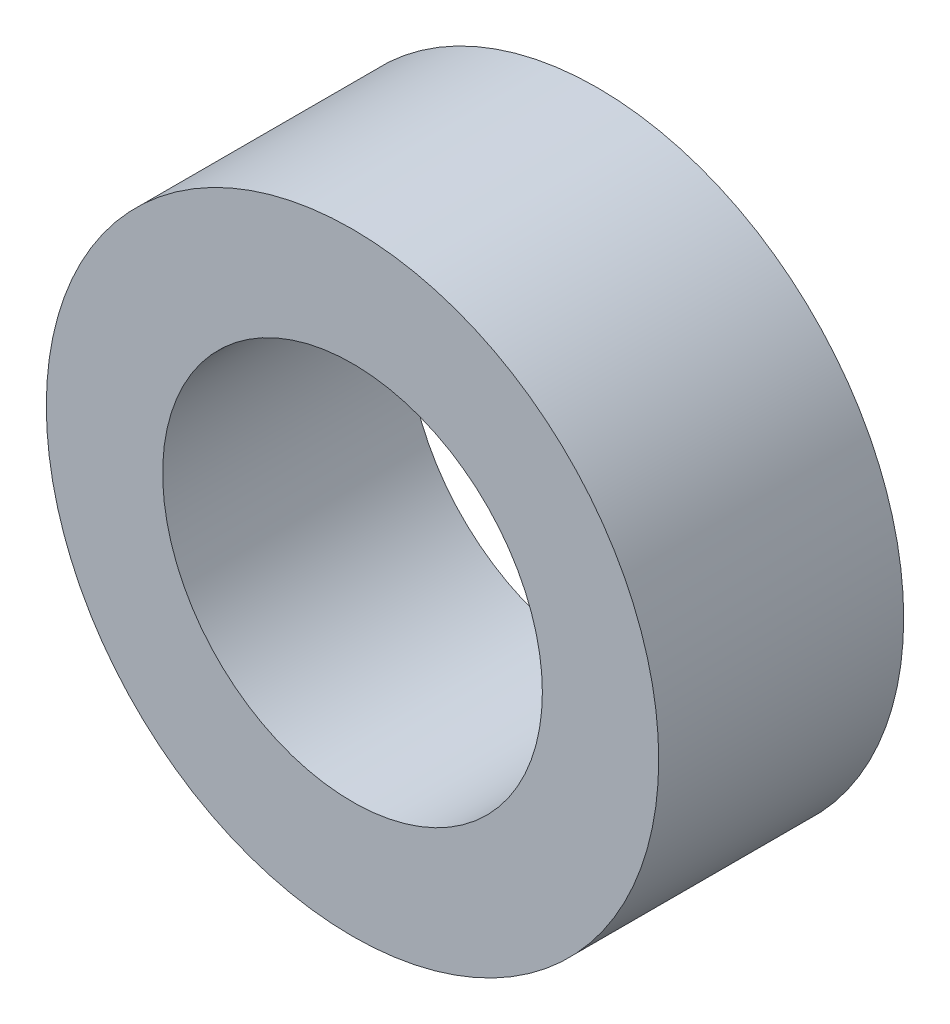
ISO-10303-21;
HEADER;
FILE_DESCRIPTION(('STEP AP214'),'2;1');
FILE_NAME('part.step','',(''),(''),'','','');
FILE_SCHEMA(('AUTOMOTIVE_DESIGN { 1 0 10303 214 1 1 1 1 }'));
ENDSEC;
DATA;
#1=APPLICATION_CONTEXT('core data for automotive mechanical design processes');
#2=APPLICATION_PROTOCOL_DEFINITION('international standard','automotive_design',2000,#1);
#3=PRODUCT_CONTEXT('',#1,'mechanical');
#4=PRODUCT('Part','Part','',(#3));
#5=PRODUCT_RELATED_PRODUCT_CATEGORY('part','',(#4));
#6=PRODUCT_DEFINITION_FORMATION('','',#4);
#7=PRODUCT_DEFINITION_CONTEXT('part definition',#1,'design');
#8=PRODUCT_DEFINITION('design','',#6,#7);
#9=PRODUCT_DEFINITION_SHAPE('','',#8);
#10=(LENGTH_UNIT() NAMED_UNIT(*) SI_UNIT(.MILLI.,.METRE.));
#11=(NAMED_UNIT(*) PLANE_ANGLE_UNIT() SI_UNIT($,.RADIAN.));
#12=(NAMED_UNIT(*) SI_UNIT($,.STERADIAN.) SOLID_ANGLE_UNIT());
#13=UNCERTAINTY_MEASURE_WITH_UNIT(LENGTH_MEASURE(1.E-05),#10,'distance_accuracy_value','');
#14=(GEOMETRIC_REPRESENTATION_CONTEXT(3) GLOBAL_UNCERTAINTY_ASSIGNED_CONTEXT((#13)) GLOBAL_UNIT_ASSIGNED_CONTEXT((#10,
#11,#12)) REPRESENTATION_CONTEXT('',''));
#15=CARTESIAN_POINT('',(0.,0.,0.));
#16=DIRECTION('',(0.,0.,1.));
#17=DIRECTION('',(1.,0.,0.));
#18=AXIS2_PLACEMENT_3D('',#15,#16,#17);
#19=CARTESIAN_POINT('',(0.,0.,4.));
#20=DIRECTION('',(0.,0.,1.));
#21=DIRECTION('',(1.,0.,0.));
#22=AXIS2_PLACEMENT_3D('',#19,#20,#21);
#23=PLANE('',#22);
#24=CARTESIAN_POINT('',(0.,0.,4.));
#25=DIRECTION('',(0.,0.,1.));
#26=DIRECTION('',(1.,0.,0.));
#27=AXIS2_PLACEMENT_3D('',#24,#25,#26);
#28=CIRCLE('',#27,5.);
#29=CARTESIAN_POINT('',(5.,0.,4.));
#30=VERTEX_POINT('',#29);
#31=EDGE_CURVE('E10',#30,#30,#28,.T.);
#32=ORIENTED_EDGE('',*,*,#31,.T.);
#33=EDGE_LOOP('',(#32));
#34=FACE_BOUND('',#33,.T.);
#35=CARTESIAN_POINT('',(0.,0.,4.));
#36=DIRECTION('',(0.,0.,1.));
#37=DIRECTION('',(1.,0.,0.));
#38=AXIS2_PLACEMENT_3D('',#35,#36,#37);
#39=CIRCLE('',#38,3.1);
#40=CARTESIAN_POINT('',(3.1,0.,4.));
#41=VERTEX_POINT('',#40);
#42=EDGE_CURVE('E50',#41,#41,#39,.T.);
#43=ORIENTED_EDGE('',*,*,#42,.F.);
#44=EDGE_LOOP('',(#43));
#45=FACE_BOUND('',#44,.T.);
#46=ADVANCED_FACE('F37',(#34,#45),#23,.T.);
#47=CARTESIAN_POINT('',(0.,0.,0.));
#48=DIRECTION('',(0.,0.,1.));
#49=DIRECTION('',(1.,0.,0.));
#50=AXIS2_PLACEMENT_3D('',#47,#48,#49);
#51=PLANE('',#50);
#52=CARTESIAN_POINT('',(0.,0.,0.));
#53=DIRECTION('',(0.,0.,1.));
#54=DIRECTION('',(1.,0.,0.));
#55=AXIS2_PLACEMENT_3D('',#52,#53,#54);
#56=CIRCLE('',#55,5.);
#57=CARTESIAN_POINT('',(5.,0.,0.));
#58=VERTEX_POINT('',#57);
#59=EDGE_CURVE('E41',#58,#58,#56,.T.);
#60=ORIENTED_EDGE('',*,*,#59,.F.);
#61=EDGE_LOOP('',(#60));
#62=FACE_BOUND('',#61,.T.);
#63=CARTESIAN_POINT('',(0.,0.,0.));
#64=DIRECTION('',(0.,0.,1.));
#65=DIRECTION('',(1.,0.,0.));
#66=AXIS2_PLACEMENT_3D('',#63,#64,#65);
#67=CIRCLE('',#66,3.1);
#68=CARTESIAN_POINT('',(3.1,0.,0.));
#69=VERTEX_POINT('',#68);
#70=EDGE_CURVE('E52',#69,#69,#67,.T.);
#71=ORIENTED_EDGE('',*,*,#70,.T.);
#72=EDGE_LOOP('',(#71));
#73=FACE_BOUND('',#72,.T.);
#74=ADVANCED_FACE('F64',(#62,#73),#51,.F.);
#75=CARTESIAN_POINT('',(0.,0.,4.));
#76=DIRECTION('',(0.,0.,-1.));
#77=DIRECTION('',(-1.,0.,0.));
#78=AXIS2_PLACEMENT_3D('',#75,#76,#77);
#79=CYLINDRICAL_SURFACE('',#78,5.);
#80=ORIENTED_EDGE('',*,*,#31,.F.);
#81=EDGE_LOOP('',(#80));
#82=FACE_BOUND('',#81,.T.);
#83=ORIENTED_EDGE('',*,*,#59,.T.);
#84=EDGE_LOOP('',(#83));
#85=FACE_BOUND('',#84,.T.);
#86=ADVANCED_FACE('F39',(#82,#85),#79,.T.);
#87=CARTESIAN_POINT('',(0.,0.,4.));
#88=DIRECTION('',(0.,0.,-1.));
#89=DIRECTION('',(-1.,0.,0.));
#90=AXIS2_PLACEMENT_3D('',#87,#88,#89);
#91=CYLINDRICAL_SURFACE('',#90,3.1);
#92=ORIENTED_EDGE('',*,*,#42,.T.);
#93=EDGE_LOOP('',(#92));
#94=FACE_BOUND('',#93,.T.);
#95=ORIENTED_EDGE('',*,*,#70,.F.);
#96=EDGE_LOOP('',(#95));
#97=FACE_BOUND('',#96,.T.);
#98=ADVANCED_FACE('F60',(#94,#97),#91,.F.);
#99=CLOSED_SHELL('',(#46,#74,#86,#98));
#100=MANIFOLD_SOLID_BREP('B2',#99);
#101=ADVANCED_BREP_SHAPE_REPRESENTATION('',(#18,#100),#14);
#102=SHAPE_DEFINITION_REPRESENTATION(#9,#101);
ENDSEC;
END-ISO-10303-21;
